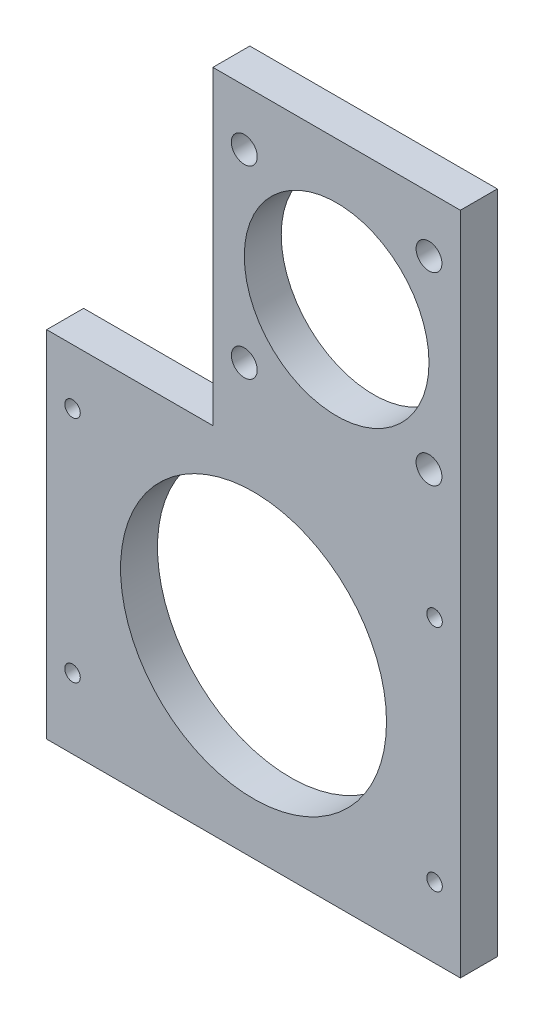
ISO-10303-21;
HEADER;
FILE_DESCRIPTION(('STEP AP214'),'2;1');
FILE_NAME('part.step','',(''),(''),'','','');
FILE_SCHEMA(('AUTOMOTIVE_DESIGN { 1 0 10303 214 1 1 1 1 }'));
ENDSEC;
DATA;
#1=APPLICATION_CONTEXT('core data for automotive mechanical design processes');
#2=APPLICATION_PROTOCOL_DEFINITION('international standard','automotive_design',2000,#1);
#3=PRODUCT_CONTEXT('',#1,'mechanical');
#4=PRODUCT('Part','Part','',(#3));
#5=PRODUCT_RELATED_PRODUCT_CATEGORY('part','',(#4));
#6=PRODUCT_DEFINITION_FORMATION('','',#4);
#7=PRODUCT_DEFINITION_CONTEXT('part definition',#1,'design');
#8=PRODUCT_DEFINITION('design','',#6,#7);
#9=PRODUCT_DEFINITION_SHAPE('','',#8);
#10=(LENGTH_UNIT() NAMED_UNIT(*) SI_UNIT(.MILLI.,.METRE.));
#11=(NAMED_UNIT(*) PLANE_ANGLE_UNIT() SI_UNIT($,.RADIAN.));
#12=(NAMED_UNIT(*) SI_UNIT($,.STERADIAN.) SOLID_ANGLE_UNIT());
#13=UNCERTAINTY_MEASURE_WITH_UNIT(LENGTH_MEASURE(1.E-05),#10,'distance_accuracy_value','');
#14=(GEOMETRIC_REPRESENTATION_CONTEXT(3) GLOBAL_UNCERTAINTY_ASSIGNED_CONTEXT((#13)) GLOBAL_UNIT_ASSIGNED_CONTEXT((#10,
#11,#12)) REPRESENTATION_CONTEXT('',''));
#15=CARTESIAN_POINT('',(0.,0.,0.));
#16=DIRECTION('',(0.,0.,1.));
#17=DIRECTION('',(1.,0.,0.));
#18=AXIS2_PLACEMENT_3D('',#15,#16,#17);
#19=CARTESIAN_POINT('',(0.,0.,10.));
#20=DIRECTION('',(0.,0.,1.));
#21=DIRECTION('',(1.,0.,0.));
#22=AXIS2_PLACEMENT_3D('',#19,#20,#21);
#23=PLANE('',#22);
#24=CARTESIAN_POINT('',(47.5,25.,10.));
#25=DIRECTION('',(0.,0.,1.));
#26=DIRECTION('',(1.,0.,0.));
#27=AXIS2_PLACEMENT_3D('',#24,#25,#26);
#28=CIRCLE('',#27,3.5);
#29=CARTESIAN_POINT('',(51.,25.,10.));
#30=VERTEX_POINT('',#29);
#31=EDGE_CURVE('E45',#30,#30,#28,.T.);
#32=ORIENTED_EDGE('',*,*,#31,.F.);
#33=EDGE_LOOP('',(#32));
#34=FACE_BOUND('',#33,.T.);
#35=CARTESIAN_POINT('',(47.5,75.,10.));
#36=DIRECTION('',(0.,0.,1.));
#37=DIRECTION('',(1.,0.,0.));
#38=AXIS2_PLACEMENT_3D('',#35,#36,#37);
#39=CIRCLE('',#38,3.5);
#40=CARTESIAN_POINT('',(51.,75.,10.));
#41=VERTEX_POINT('',#40);
#42=EDGE_CURVE('E222',#41,#41,#39,.T.);
#43=ORIENTED_EDGE('',*,*,#42,.F.);
#44=EDGE_LOOP('',(#43));
#45=FACE_BOUND('',#44,.T.);
#46=CARTESIAN_POINT('',(-2.5,75.,10.));
#47=DIRECTION('',(0.,0.,1.));
#48=DIRECTION('',(1.,0.,0.));
#49=AXIS2_PLACEMENT_3D('',#46,#47,#48);
#50=CIRCLE('',#49,3.5);
#51=CARTESIAN_POINT('',(1.,75.,10.));
#52=VERTEX_POINT('',#51);
#53=EDGE_CURVE('E228',#52,#52,#50,.T.);
#54=ORIENTED_EDGE('',*,*,#53,.F.);
#55=EDGE_LOOP('',(#54));
#56=FACE_BOUND('',#55,.T.);
#57=CARTESIAN_POINT('',(-2.5,25.,10.));
#58=DIRECTION('',(0.,0.,1.));
#59=DIRECTION('',(1.,0.,0.));
#60=AXIS2_PLACEMENT_3D('',#57,#58,#59);
#61=CIRCLE('',#60,3.5);
#62=CARTESIAN_POINT('',(0.999999999999996,25.,10.));
#63=VERTEX_POINT('',#62);
#64=EDGE_CURVE('E234',#63,#63,#61,.T.);
#65=ORIENTED_EDGE('',*,*,#64,.F.);
#66=EDGE_LOOP('',(#65));
#67=FACE_BOUND('',#66,.T.);
#68=CARTESIAN_POINT('',(49.,-8.99999999999999,10.));
#69=DIRECTION('',(0.,0.,1.));
#70=DIRECTION('',(1.,0.,0.));
#71=AXIS2_PLACEMENT_3D('',#68,#69,#70);
#72=CIRCLE('',#71,2.1);
#73=CARTESIAN_POINT('',(51.1,-8.99999999999999,10.));
#74=VERTEX_POINT('',#73);
#75=EDGE_CURVE('E240',#74,#74,#72,.T.);
#76=ORIENTED_EDGE('',*,*,#75,.F.);
#77=EDGE_LOOP('',(#76));
#78=FACE_BOUND('',#77,.T.);
#79=CARTESIAN_POINT('',(-49.,-8.99999999999999,10.));
#80=DIRECTION('',(0.,0.,1.));
#81=DIRECTION('',(1.,0.,0.));
#82=AXIS2_PLACEMENT_3D('',#79,#80,#81);
#83=CIRCLE('',#82,2.1);
#84=CARTESIAN_POINT('',(-46.9,-8.99999999999999,10.));
#85=VERTEX_POINT('',#84);
#86=EDGE_CURVE('E246',#85,#85,#83,.T.);
#87=ORIENTED_EDGE('',*,*,#86,.F.);
#88=EDGE_LOOP('',(#87));
#89=FACE_BOUND('',#88,.T.);
#90=CARTESIAN_POINT('',(-49.,-71.,10.));
#91=DIRECTION('',(0.,0.,1.));
#92=DIRECTION('',(1.,0.,0.));
#93=AXIS2_PLACEMENT_3D('',#90,#91,#92);
#94=CIRCLE('',#93,2.1);
#95=CARTESIAN_POINT('',(-46.9,-71.,10.));
#96=VERTEX_POINT('',#95);
#97=EDGE_CURVE('E252',#96,#96,#94,.T.);
#98=ORIENTED_EDGE('',*,*,#97,.F.);
#99=EDGE_LOOP('',(#98));
#100=FACE_BOUND('',#99,.T.);
#101=CARTESIAN_POINT('',(49.,-71.,10.));
#102=DIRECTION('',(0.,0.,1.));
#103=DIRECTION('',(1.,0.,0.));
#104=AXIS2_PLACEMENT_3D('',#101,#102,#103);
#105=CIRCLE('',#104,2.1);
#106=CARTESIAN_POINT('',(51.1,-71.,10.));
#107=VERTEX_POINT('',#106);
#108=EDGE_CURVE('E258',#107,#107,#105,.T.);
#109=ORIENTED_EDGE('',*,*,#108,.F.);
#110=EDGE_LOOP('',(#109));
#111=FACE_BOUND('',#110,.T.);
#112=CARTESIAN_POINT('',(0.,-40.,10.));
#113=DIRECTION('',(0.,0.,1.));
#114=DIRECTION('',(1.,0.,0.));
#115=AXIS2_PLACEMENT_3D('',#112,#113,#114);
#116=CIRCLE('',#115,36.);
#117=CARTESIAN_POINT('',(36.,-40.,10.));
#118=VERTEX_POINT('',#117);
#119=EDGE_CURVE('E131',#118,#118,#116,.T.);
#120=ORIENTED_EDGE('',*,*,#119,.F.);
#121=EDGE_LOOP('',(#120));
#122=FACE_BOUND('',#121,.T.);
#123=DIRECTION('',(0.,1.,0.));
#124=VECTOR('',#123,1.);
#125=CARTESIAN_POINT('',(56.,90.,10.));
#126=LINE('',#125,#124);
#127=CARTESIAN_POINT('',(56.,-90.,10.));
#128=VERTEX_POINT('',#127);
#129=CARTESIAN_POINT('',(56.,90.,10.));
#130=VERTEX_POINT('',#129);
#131=EDGE_CURVE('E138',#128,#130,#126,.T.);
#132=ORIENTED_EDGE('',*,*,#131,.T.);
#133=DIRECTION('',(-1.,0.,0.));
#134=VECTOR('',#133,1.);
#135=CARTESIAN_POINT('',(-11.,90.,10.));
#136=LINE('',#135,#134);
#137=CARTESIAN_POINT('',(-11.,90.,10.));
#138=VERTEX_POINT('',#137);
#139=EDGE_CURVE('E96',#130,#138,#136,.T.);
#140=ORIENTED_EDGE('',*,*,#139,.T.);
#141=DIRECTION('',(0.,-1.,0.));
#142=VECTOR('',#141,1.);
#143=CARTESIAN_POINT('',(-11.,90.,10.));
#144=LINE('',#143,#142);
#145=CARTESIAN_POINT('',(-11.,6.00000000000001,10.));
#146=VERTEX_POINT('',#145);
#147=EDGE_CURVE('E109',#138,#146,#144,.T.);
#148=ORIENTED_EDGE('',*,*,#147,.T.);
#149=DIRECTION('',(-1.,0.,0.));
#150=VECTOR('',#149,1.);
#151=CARTESIAN_POINT('',(-11.,6.00000000000001,10.));
#152=LINE('',#151,#150);
#153=CARTESIAN_POINT('',(-56.,6.,10.));
#154=VERTEX_POINT('',#153);
#155=EDGE_CURVE('E103',#146,#154,#152,.T.);
#156=ORIENTED_EDGE('',*,*,#155,.T.);
#157=DIRECTION('',(0.,-1.,0.));
#158=VECTOR('',#157,1.);
#159=CARTESIAN_POINT('',(-56.,6.,10.));
#160=LINE('',#159,#158);
#161=CARTESIAN_POINT('',(-56.,-90.,10.));
#162=VERTEX_POINT('',#161);
#163=EDGE_CURVE('E107',#154,#162,#160,.T.);
#164=ORIENTED_EDGE('',*,*,#163,.T.);
#165=DIRECTION('',(1.,0.,0.));
#166=VECTOR('',#165,1.);
#167=CARTESIAN_POINT('',(-56.,-90.,10.));
#168=LINE('',#167,#166);
#169=EDGE_CURVE('E59',#162,#128,#168,.T.);
#170=ORIENTED_EDGE('',*,*,#169,.T.);
#171=EDGE_LOOP('',(#132,#140,#148,#156,#164,#170));
#172=FACE_BOUND('',#171,.T.);
#173=CARTESIAN_POINT('',(22.5,50.,10.));
#174=DIRECTION('',(0.,0.,1.));
#175=DIRECTION('',(1.,0.,0.));
#176=AXIS2_PLACEMENT_3D('',#173,#174,#175);
#177=CIRCLE('',#176,25.);
#178=CARTESIAN_POINT('',(47.5,50.,10.));
#179=VERTEX_POINT('',#178);
#180=EDGE_CURVE('E262',#179,#179,#177,.T.);
#181=ORIENTED_EDGE('',*,*,#180,.F.);
#182=EDGE_LOOP('',(#181));
#183=FACE_BOUND('',#182,.T.);
#184=ADVANCED_FACE('F41',(#34,#45,#56,#67,#78,#89,#100,#111,#122,#172,#183),#23,.T.);
#185=CARTESIAN_POINT('',(0.,0.,0.));
#186=DIRECTION('',(0.,0.,1.));
#187=DIRECTION('',(1.,0.,0.));
#188=AXIS2_PLACEMENT_3D('',#185,#186,#187);
#189=PLANE('',#188);
#190=CARTESIAN_POINT('',(47.5,25.,0.));
#191=DIRECTION('',(0.,0.,-1.));
#192=DIRECTION('',(-1.,0.,0.));
#193=AXIS2_PLACEMENT_3D('',#190,#191,#192);
#194=CIRCLE('',#193,3.5);
#195=CARTESIAN_POINT('',(44.,25.,0.));
#196=VERTEX_POINT('',#195);
#197=EDGE_CURVE('E216',#196,#196,#194,.T.);
#198=ORIENTED_EDGE('',*,*,#197,.F.);
#199=EDGE_LOOP('',(#198));
#200=FACE_BOUND('',#199,.T.);
#201=CARTESIAN_POINT('',(47.5,75.,0.));
#202=DIRECTION('',(0.,0.,-1.));
#203=DIRECTION('',(-1.,0.,0.));
#204=AXIS2_PLACEMENT_3D('',#201,#202,#203);
#205=CIRCLE('',#204,3.5);
#206=CARTESIAN_POINT('',(44.,75.,0.));
#207=VERTEX_POINT('',#206);
#208=EDGE_CURVE('E218',#207,#207,#205,.T.);
#209=ORIENTED_EDGE('',*,*,#208,.F.);
#210=EDGE_LOOP('',(#209));
#211=FACE_BOUND('',#210,.T.);
#212=CARTESIAN_POINT('',(-2.5,75.,0.));
#213=DIRECTION('',(0.,0.,-1.));
#214=DIRECTION('',(-1.,0.,0.));
#215=AXIS2_PLACEMENT_3D('',#212,#213,#214);
#216=CIRCLE('',#215,3.5);
#217=CARTESIAN_POINT('',(-5.99999999999999,75.,0.));
#218=VERTEX_POINT('',#217);
#219=EDGE_CURVE('E225',#218,#218,#216,.T.);
#220=ORIENTED_EDGE('',*,*,#219,.F.);
#221=EDGE_LOOP('',(#220));
#222=FACE_BOUND('',#221,.T.);
#223=CARTESIAN_POINT('',(-2.5,25.,0.));
#224=DIRECTION('',(0.,0.,-1.));
#225=DIRECTION('',(-1.,0.,0.));
#226=AXIS2_PLACEMENT_3D('',#223,#224,#225);
#227=CIRCLE('',#226,3.5);
#228=CARTESIAN_POINT('',(-6.,25.,0.));
#229=VERTEX_POINT('',#228);
#230=EDGE_CURVE('E231',#229,#229,#227,.T.);
#231=ORIENTED_EDGE('',*,*,#230,.F.);
#232=EDGE_LOOP('',(#231));
#233=FACE_BOUND('',#232,.T.);
#234=CARTESIAN_POINT('',(49.,-8.99999999999999,0.));
#235=DIRECTION('',(0.,0.,-1.));
#236=DIRECTION('',(-1.,0.,0.));
#237=AXIS2_PLACEMENT_3D('',#234,#235,#236);
#238=CIRCLE('',#237,2.1);
#239=CARTESIAN_POINT('',(46.9,-8.99999999999999,0.));
#240=VERTEX_POINT('',#239);
#241=EDGE_CURVE('E237',#240,#240,#238,.T.);
#242=ORIENTED_EDGE('',*,*,#241,.F.);
#243=EDGE_LOOP('',(#242));
#244=FACE_BOUND('',#243,.T.);
#245=CARTESIAN_POINT('',(-49.,-8.99999999999999,0.));
#246=DIRECTION('',(0.,0.,-1.));
#247=DIRECTION('',(-1.,0.,0.));
#248=AXIS2_PLACEMENT_3D('',#245,#246,#247);
#249=CIRCLE('',#248,2.1);
#250=CARTESIAN_POINT('',(-51.1,-8.99999999999999,0.));
#251=VERTEX_POINT('',#250);
#252=EDGE_CURVE('E243',#251,#251,#249,.T.);
#253=ORIENTED_EDGE('',*,*,#252,.F.);
#254=EDGE_LOOP('',(#253));
#255=FACE_BOUND('',#254,.T.);
#256=CARTESIAN_POINT('',(-49.,-71.,0.));
#257=DIRECTION('',(0.,0.,-1.));
#258=DIRECTION('',(-1.,0.,0.));
#259=AXIS2_PLACEMENT_3D('',#256,#257,#258);
#260=CIRCLE('',#259,2.1);
#261=CARTESIAN_POINT('',(-51.1,-71.,0.));
#262=VERTEX_POINT('',#261);
#263=EDGE_CURVE('E249',#262,#262,#260,.T.);
#264=ORIENTED_EDGE('',*,*,#263,.F.);
#265=EDGE_LOOP('',(#264));
#266=FACE_BOUND('',#265,.T.);
#267=CARTESIAN_POINT('',(49.,-71.,0.));
#268=DIRECTION('',(0.,0.,-1.));
#269=DIRECTION('',(-1.,0.,0.));
#270=AXIS2_PLACEMENT_3D('',#267,#268,#269);
#271=CIRCLE('',#270,2.1);
#272=CARTESIAN_POINT('',(46.9,-71.,0.));
#273=VERTEX_POINT('',#272);
#274=EDGE_CURVE('E255',#273,#273,#271,.T.);
#275=ORIENTED_EDGE('',*,*,#274,.F.);
#276=EDGE_LOOP('',(#275));
#277=FACE_BOUND('',#276,.T.);
#278=DIRECTION('',(0.,1.,0.));
#279=VECTOR('',#278,1.);
#280=CARTESIAN_POINT('',(56.,90.,0.));
#281=LINE('',#280,#279);
#282=CARTESIAN_POINT('',(56.,-90.,0.));
#283=VERTEX_POINT('',#282);
#284=CARTESIAN_POINT('',(56.,90.,0.));
#285=VERTEX_POINT('',#284);
#286=EDGE_CURVE('E127',#283,#285,#281,.T.);
#287=ORIENTED_EDGE('',*,*,#286,.F.);
#288=DIRECTION('',(1.,0.,0.));
#289=VECTOR('',#288,1.);
#290=CARTESIAN_POINT('',(-56.,-90.,0.));
#291=LINE('',#290,#289);
#292=CARTESIAN_POINT('',(-56.,-90.,0.));
#293=VERTEX_POINT('',#292);
#294=EDGE_CURVE('E88',#293,#283,#291,.T.);
#295=ORIENTED_EDGE('',*,*,#294,.F.);
#296=DIRECTION('',(0.,-1.,0.));
#297=VECTOR('',#296,1.);
#298=CARTESIAN_POINT('',(-56.,6.,0.));
#299=LINE('',#298,#297);
#300=CARTESIAN_POINT('',(-56.,6.,0.));
#301=VERTEX_POINT('',#300);
#302=EDGE_CURVE('E82',#301,#293,#299,.T.);
#303=ORIENTED_EDGE('',*,*,#302,.F.);
#304=DIRECTION('',(-1.,0.,0.));
#305=VECTOR('',#304,1.);
#306=CARTESIAN_POINT('',(-11.,6.00000000000001,0.));
#307=LINE('',#306,#305);
#308=CARTESIAN_POINT('',(-11.,6.00000000000001,0.));
#309=VERTEX_POINT('',#308);
#310=EDGE_CURVE('E117',#309,#301,#307,.T.);
#311=ORIENTED_EDGE('',*,*,#310,.F.);
#312=DIRECTION('',(0.,-1.,0.));
#313=VECTOR('',#312,1.);
#314=CARTESIAN_POINT('',(-11.,90.,0.));
#315=LINE('',#314,#313);
#316=CARTESIAN_POINT('',(-11.,90.,0.));
#317=VERTEX_POINT('',#316);
#318=EDGE_CURVE('E133',#317,#309,#315,.T.);
#319=ORIENTED_EDGE('',*,*,#318,.F.);
#320=DIRECTION('',(-1.,0.,0.));
#321=VECTOR('',#320,1.);
#322=CARTESIAN_POINT('',(-11.,90.,0.));
#323=LINE('',#322,#321);
#324=EDGE_CURVE('E130',#285,#317,#323,.T.);
#325=ORIENTED_EDGE('',*,*,#324,.F.);
#326=EDGE_LOOP('',(#287,#295,#303,#311,#319,#325));
#327=FACE_BOUND('',#326,.T.);
#328=CARTESIAN_POINT('',(0.,-40.,0.));
#329=DIRECTION('',(0.,0.,1.));
#330=DIRECTION('',(1.,0.,0.));
#331=AXIS2_PLACEMENT_3D('',#328,#329,#330);
#332=CIRCLE('',#331,36.);
#333=CARTESIAN_POINT('',(36.,-40.,0.));
#334=VERTEX_POINT('',#333);
#335=EDGE_CURVE('E265',#334,#334,#332,.T.);
#336=ORIENTED_EDGE('',*,*,#335,.T.);
#337=EDGE_LOOP('',(#336));
#338=FACE_BOUND('',#337,.T.);
#339=CARTESIAN_POINT('',(22.5,50.,0.));
#340=DIRECTION('',(0.,0.,1.));
#341=DIRECTION('',(1.,0.,0.));
#342=AXIS2_PLACEMENT_3D('',#339,#340,#341);
#343=CIRCLE('',#342,25.);
#344=CARTESIAN_POINT('',(47.5,50.,0.));
#345=VERTEX_POINT('',#344);
#346=EDGE_CURVE('E261',#345,#345,#343,.T.);
#347=ORIENTED_EDGE('',*,*,#346,.T.);
#348=EDGE_LOOP('',(#347));
#349=FACE_BOUND('',#348,.T.);
#350=ADVANCED_FACE('F148',(#200,#211,#222,#233,#244,#255,#266,#277,#327,#338,#349),#189,.F.);
#351=CARTESIAN_POINT('',(56.,90.,10.));
#352=DIRECTION('',(-1.,0.,0.));
#353=DIRECTION('',(0.,-1.,0.));
#354=AXIS2_PLACEMENT_3D('',#351,#352,#353);
#355=PLANE('',#354);
#356=ORIENTED_EDGE('',*,*,#286,.T.);
#357=DIRECTION('',(0.,0.,-1.));
#358=VECTOR('',#357,1.);
#359=CARTESIAN_POINT('',(56.,90.,10.));
#360=LINE('',#359,#358);
#361=EDGE_CURVE('E11',#130,#285,#360,.T.);
#362=ORIENTED_EDGE('',*,*,#361,.F.);
#363=ORIENTED_EDGE('',*,*,#131,.F.);
#364=DIRECTION('',(0.,0.,-1.));
#365=VECTOR('',#364,1.);
#366=CARTESIAN_POINT('',(56.,-90.,10.));
#367=LINE('',#366,#365);
#368=EDGE_CURVE('E123',#128,#283,#367,.T.);
#369=ORIENTED_EDGE('',*,*,#368,.T.);
#370=EDGE_LOOP('',(#356,#362,#363,#369));
#371=FACE_BOUND('',#370,.T.);
#372=ADVANCED_FACE('F43',(#371),#355,.F.);
#373=CARTESIAN_POINT('',(-11.,90.,10.));
#374=DIRECTION('',(0.,-1.,0.));
#375=DIRECTION('',(0.,0.,-1.));
#376=AXIS2_PLACEMENT_3D('',#373,#374,#375);
#377=PLANE('',#376);
#378=ORIENTED_EDGE('',*,*,#324,.T.);
#379=DIRECTION('',(0.,0.,-1.));
#380=VECTOR('',#379,1.);
#381=CARTESIAN_POINT('',(-11.,90.,10.));
#382=LINE('',#381,#380);
#383=EDGE_CURVE('E51',#138,#317,#382,.T.);
#384=ORIENTED_EDGE('',*,*,#383,.F.);
#385=ORIENTED_EDGE('',*,*,#139,.F.);
#386=ORIENTED_EDGE('',*,*,#361,.T.);
#387=EDGE_LOOP('',(#378,#384,#385,#386));
#388=FACE_BOUND('',#387,.T.);
#389=ADVANCED_FACE('F381',(#388),#377,.F.);
#390=CARTESIAN_POINT('',(-11.,90.,10.));
#391=DIRECTION('',(1.,0.,0.));
#392=DIRECTION('',(0.,1.,0.));
#393=AXIS2_PLACEMENT_3D('',#390,#391,#392);
#394=PLANE('',#393);
#395=ORIENTED_EDGE('',*,*,#318,.T.);
#396=DIRECTION('',(0.,0.,-1.));
#397=VECTOR('',#396,1.);
#398=CARTESIAN_POINT('',(-11.,6.00000000000001,10.));
#399=LINE('',#398,#397);
#400=EDGE_CURVE('E118',#146,#309,#399,.T.);
#401=ORIENTED_EDGE('',*,*,#400,.F.);
#402=ORIENTED_EDGE('',*,*,#147,.F.);
#403=ORIENTED_EDGE('',*,*,#383,.T.);
#404=EDGE_LOOP('',(#395,#401,#402,#403));
#405=FACE_BOUND('',#404,.T.);
#406=ADVANCED_FACE('F145',(#405),#394,.F.);
#407=CARTESIAN_POINT('',(-11.,6.00000000000001,10.));
#408=DIRECTION('',(0.,-1.,0.));
#409=DIRECTION('',(1.,0.,0.));
#410=AXIS2_PLACEMENT_3D('',#407,#408,#409);
#411=PLANE('',#410);
#412=ORIENTED_EDGE('',*,*,#310,.T.);
#413=DIRECTION('',(0.,0.,-1.));
#414=VECTOR('',#413,1.);
#415=CARTESIAN_POINT('',(-56.,6.,10.));
#416=LINE('',#415,#414);
#417=EDGE_CURVE('E114',#154,#301,#416,.T.);
#418=ORIENTED_EDGE('',*,*,#417,.F.);
#419=ORIENTED_EDGE('',*,*,#155,.F.);
#420=ORIENTED_EDGE('',*,*,#400,.T.);
#421=EDGE_LOOP('',(#412,#418,#419,#420));
#422=FACE_BOUND('',#421,.T.);
#423=ADVANCED_FACE('F115',(#422),#411,.F.);
#424=CARTESIAN_POINT('',(-56.,6.,10.));
#425=DIRECTION('',(1.,0.,0.));
#426=DIRECTION('',(0.,1.,0.));
#427=AXIS2_PLACEMENT_3D('',#424,#425,#426);
#428=PLANE('',#427);
#429=ORIENTED_EDGE('',*,*,#302,.T.);
#430=DIRECTION('',(0.,0.,-1.));
#431=VECTOR('',#430,1.);
#432=CARTESIAN_POINT('',(-56.,-90.,10.));
#433=LINE('',#432,#431);
#434=EDGE_CURVE('E119',#162,#293,#433,.T.);
#435=ORIENTED_EDGE('',*,*,#434,.F.);
#436=ORIENTED_EDGE('',*,*,#163,.F.);
#437=ORIENTED_EDGE('',*,*,#417,.T.);
#438=EDGE_LOOP('',(#429,#435,#436,#437));
#439=FACE_BOUND('',#438,.T.);
#440=ADVANCED_FACE('F121',(#439),#428,.F.);
#441=CARTESIAN_POINT('',(-56.,-90.,10.));
#442=DIRECTION('',(0.,1.,0.));
#443=DIRECTION('',(0.,0.,1.));
#444=AXIS2_PLACEMENT_3D('',#441,#442,#443);
#445=PLANE('',#444);
#446=ORIENTED_EDGE('',*,*,#294,.T.);
#447=ORIENTED_EDGE('',*,*,#368,.F.);
#448=ORIENTED_EDGE('',*,*,#169,.F.);
#449=ORIENTED_EDGE('',*,*,#434,.T.);
#450=EDGE_LOOP('',(#446,#447,#448,#449));
#451=FACE_BOUND('',#450,.T.);
#452=ADVANCED_FACE('F153',(#451),#445,.F.);
#453=CARTESIAN_POINT('',(0.,-40.,10.));
#454=DIRECTION('',(0.,0.,-1.));
#455=DIRECTION('',(-1.,0.,0.));
#456=AXIS2_PLACEMENT_3D('',#453,#454,#455);
#457=CYLINDRICAL_SURFACE('',#456,36.);
#458=ORIENTED_EDGE('',*,*,#119,.T.);
#459=EDGE_LOOP('',(#458));
#460=FACE_BOUND('',#459,.T.);
#461=ORIENTED_EDGE('',*,*,#335,.F.);
#462=EDGE_LOOP('',(#461));
#463=FACE_BOUND('',#462,.T.);
#464=ADVANCED_FACE('F155',(#460,#463),#457,.F.);
#465=CARTESIAN_POINT('',(22.5,50.,10.));
#466=DIRECTION('',(0.,0.,-1.));
#467=DIRECTION('',(-1.,0.,0.));
#468=AXIS2_PLACEMENT_3D('',#465,#466,#467);
#469=CYLINDRICAL_SURFACE('',#468,25.);
#470=ORIENTED_EDGE('',*,*,#180,.T.);
#471=EDGE_LOOP('',(#470));
#472=FACE_BOUND('',#471,.T.);
#473=ORIENTED_EDGE('',*,*,#346,.F.);
#474=EDGE_LOOP('',(#473));
#475=FACE_BOUND('',#474,.T.);
#476=ADVANCED_FACE('F161',(#472,#475),#469,.F.);
#477=CARTESIAN_POINT('',(49.,-71.,0.));
#478=DIRECTION('',(0.,0.,-1.));
#479=DIRECTION('',(-1.,0.,0.));
#480=AXIS2_PLACEMENT_3D('',#477,#478,#479);
#481=CYLINDRICAL_SURFACE('',#480,2.1);
#482=ORIENTED_EDGE('',*,*,#108,.T.);
#483=EDGE_LOOP('',(#482));
#484=FACE_BOUND('',#483,.T.);
#485=ORIENTED_EDGE('',*,*,#274,.T.);
#486=EDGE_LOOP('',(#485));
#487=FACE_BOUND('',#486,.T.);
#488=ADVANCED_FACE('F178',(#484,#487),#481,.F.);
#489=CARTESIAN_POINT('',(-49.,-71.,0.));
#490=DIRECTION('',(0.,0.,-1.));
#491=DIRECTION('',(-1.,0.,0.));
#492=AXIS2_PLACEMENT_3D('',#489,#490,#491);
#493=CYLINDRICAL_SURFACE('',#492,2.1);
#494=ORIENTED_EDGE('',*,*,#97,.T.);
#495=EDGE_LOOP('',(#494));
#496=FACE_BOUND('',#495,.T.);
#497=ORIENTED_EDGE('',*,*,#263,.T.);
#498=EDGE_LOOP('',(#497));
#499=FACE_BOUND('',#498,.T.);
#500=ADVANCED_FACE('F182',(#496,#499),#493,.F.);
#501=CARTESIAN_POINT('',(-49.,-8.99999999999999,0.));
#502=DIRECTION('',(0.,0.,-1.));
#503=DIRECTION('',(-1.,0.,0.));
#504=AXIS2_PLACEMENT_3D('',#501,#502,#503);
#505=CYLINDRICAL_SURFACE('',#504,2.1);
#506=ORIENTED_EDGE('',*,*,#86,.T.);
#507=EDGE_LOOP('',(#506));
#508=FACE_BOUND('',#507,.T.);
#509=ORIENTED_EDGE('',*,*,#252,.T.);
#510=EDGE_LOOP('',(#509));
#511=FACE_BOUND('',#510,.T.);
#512=ADVANCED_FACE('F186',(#508,#511),#505,.F.);
#513=CARTESIAN_POINT('',(49.,-8.99999999999999,0.));
#514=DIRECTION('',(0.,0.,-1.));
#515=DIRECTION('',(-1.,0.,0.));
#516=AXIS2_PLACEMENT_3D('',#513,#514,#515);
#517=CYLINDRICAL_SURFACE('',#516,2.1);
#518=ORIENTED_EDGE('',*,*,#75,.T.);
#519=EDGE_LOOP('',(#518));
#520=FACE_BOUND('',#519,.T.);
#521=ORIENTED_EDGE('',*,*,#241,.T.);
#522=EDGE_LOOP('',(#521));
#523=FACE_BOUND('',#522,.T.);
#524=ADVANCED_FACE('F190',(#520,#523),#517,.F.);
#525=CARTESIAN_POINT('',(-2.5,25.,0.));
#526=DIRECTION('',(0.,0.,-1.));
#527=DIRECTION('',(-1.,0.,0.));
#528=AXIS2_PLACEMENT_3D('',#525,#526,#527);
#529=CYLINDRICAL_SURFACE('',#528,3.5);
#530=ORIENTED_EDGE('',*,*,#64,.T.);
#531=EDGE_LOOP('',(#530));
#532=FACE_BOUND('',#531,.T.);
#533=ORIENTED_EDGE('',*,*,#230,.T.);
#534=EDGE_LOOP('',(#533));
#535=FACE_BOUND('',#534,.T.);
#536=ADVANCED_FACE('F194',(#532,#535),#529,.F.);
#537=CARTESIAN_POINT('',(-2.5,75.,0.));
#538=DIRECTION('',(0.,0.,-1.));
#539=DIRECTION('',(-1.,0.,0.));
#540=AXIS2_PLACEMENT_3D('',#537,#538,#539);
#541=CYLINDRICAL_SURFACE('',#540,3.5);
#542=ORIENTED_EDGE('',*,*,#53,.T.);
#543=EDGE_LOOP('',(#542));
#544=FACE_BOUND('',#543,.T.);
#545=ORIENTED_EDGE('',*,*,#219,.T.);
#546=EDGE_LOOP('',(#545));
#547=FACE_BOUND('',#546,.T.);
#548=ADVANCED_FACE('F198',(#544,#547),#541,.F.);
#549=CARTESIAN_POINT('',(47.5,75.,0.));
#550=DIRECTION('',(0.,0.,-1.));
#551=DIRECTION('',(-1.,0.,0.));
#552=AXIS2_PLACEMENT_3D('',#549,#550,#551);
#553=CYLINDRICAL_SURFACE('',#552,3.5);
#554=ORIENTED_EDGE('',*,*,#42,.T.);
#555=EDGE_LOOP('',(#554));
#556=FACE_BOUND('',#555,.T.);
#557=ORIENTED_EDGE('',*,*,#208,.T.);
#558=EDGE_LOOP('',(#557));
#559=FACE_BOUND('',#558,.T.);
#560=ADVANCED_FACE('F202',(#556,#559),#553,.F.);
#561=CARTESIAN_POINT('',(47.5,25.,0.));
#562=DIRECTION('',(0.,0.,-1.));
#563=DIRECTION('',(-1.,0.,0.));
#564=AXIS2_PLACEMENT_3D('',#561,#562,#563);
#565=CYLINDRICAL_SURFACE('',#564,3.5);
#566=ORIENTED_EDGE('',*,*,#31,.T.);
#567=EDGE_LOOP('',(#566));
#568=FACE_BOUND('',#567,.T.);
#569=ORIENTED_EDGE('',*,*,#197,.T.);
#570=EDGE_LOOP('',(#569));
#571=FACE_BOUND('',#570,.T.);
#572=ADVANCED_FACE('F206',(#568,#571),#565,.F.);
#573=CLOSED_SHELL('',(#184,#350,#372,#389,#406,#423,#440,#452,#464,#476,#488,#500,#512,#524,
#536,#548,#560,#572));
#574=MANIFOLD_SOLID_BREP('B2',#573);
#575=ADVANCED_BREP_SHAPE_REPRESENTATION('',(#18,#574),#14);
#576=SHAPE_DEFINITION_REPRESENTATION(#9,#575);
ENDSEC;
END-ISO-10303-21;
